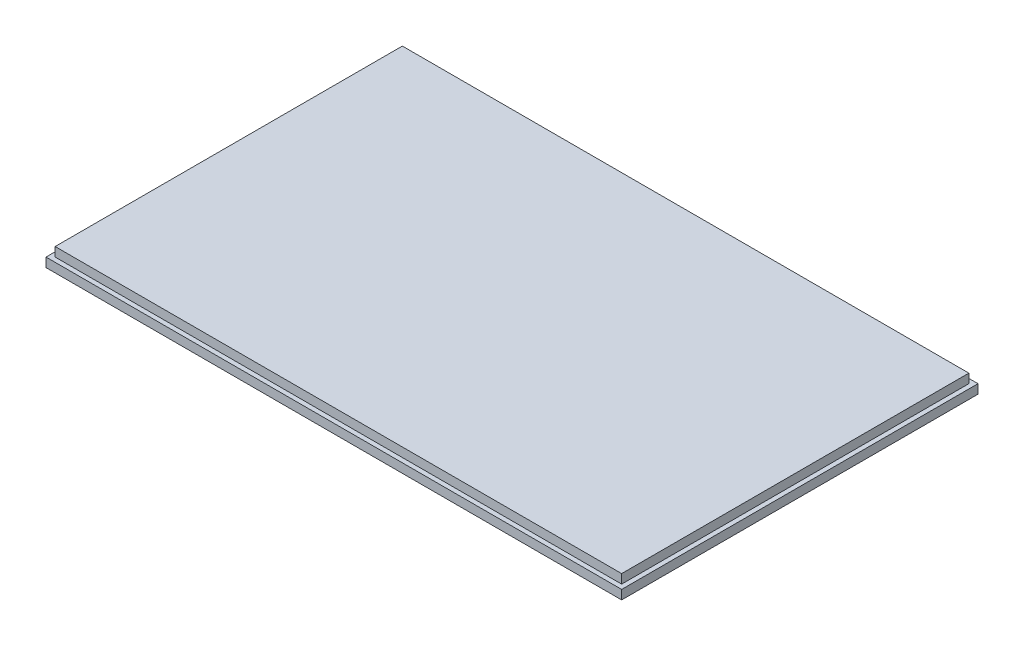
ISO-10303-21;
HEADER;
FILE_DESCRIPTION(('STEP AP214'),'2;1');
FILE_NAME('part.step','',(''),(''),'','','');
FILE_SCHEMA(('AUTOMOTIVE_DESIGN { 1 0 10303 214 1 1 1 1 }'));
ENDSEC;
DATA;
#1=APPLICATION_CONTEXT('core data for automotive mechanical design processes');
#2=APPLICATION_PROTOCOL_DEFINITION('international standard','automotive_design',2000,#1);
#3=PRODUCT_CONTEXT('',#1,'mechanical');
#4=PRODUCT('Part','Part','',(#3));
#5=PRODUCT_RELATED_PRODUCT_CATEGORY('part','',(#4));
#6=PRODUCT_DEFINITION_FORMATION('','',#4);
#7=PRODUCT_DEFINITION_CONTEXT('part definition',#1,'design');
#8=PRODUCT_DEFINITION('design','',#6,#7);
#9=PRODUCT_DEFINITION_SHAPE('','',#8);
#10=(LENGTH_UNIT() NAMED_UNIT(*) SI_UNIT(.MILLI.,.METRE.));
#11=(NAMED_UNIT(*) PLANE_ANGLE_UNIT() SI_UNIT($,.RADIAN.));
#12=(NAMED_UNIT(*) SI_UNIT($,.STERADIAN.) SOLID_ANGLE_UNIT());
#13=UNCERTAINTY_MEASURE_WITH_UNIT(LENGTH_MEASURE(1.E-05),#10,'distance_accuracy_value','');
#14=(GEOMETRIC_REPRESENTATION_CONTEXT(3) GLOBAL_UNCERTAINTY_ASSIGNED_CONTEXT((#13)) GLOBAL_UNIT_ASSIGNED_CONTEXT((#10,
#11,#12)) REPRESENTATION_CONTEXT('',''));
#15=CARTESIAN_POINT('',(0.,0.,0.));
#16=DIRECTION('',(0.,0.,1.));
#17=DIRECTION('',(1.,0.,0.));
#18=AXIS2_PLACEMENT_3D('',#15,#16,#17);
#19=CARTESIAN_POINT('',(0.,3.175,0.));
#20=DIRECTION('',(0.,-1.,0.));
#21=DIRECTION('',(0.,0.,-1.));
#22=AXIS2_PLACEMENT_3D('',#19,#20,#21);
#23=PLANE('',#22);
#24=DIRECTION('',(0.,0.,-1.));
#25=VECTOR('',#24,1.);
#26=CARTESIAN_POINT('',(100.0125,3.175,61.9125));
#27=LINE('',#26,#25);
#28=CARTESIAN_POINT('',(100.0125,3.175,61.9125));
#29=VERTEX_POINT('',#28);
#30=CARTESIAN_POINT('',(100.0125,3.175,-61.9125));
#31=VERTEX_POINT('',#30);
#32=EDGE_CURVE('E129',#29,#31,#27,.T.);
#33=ORIENTED_EDGE('',*,*,#32,.T.);
#34=DIRECTION('',(-1.,0.,0.));
#35=VECTOR('',#34,1.);
#36=CARTESIAN_POINT('',(-100.0125,3.175,-61.9125));
#37=LINE('',#36,#35);
#38=CARTESIAN_POINT('',(-100.0125,3.175,-61.9125));
#39=VERTEX_POINT('',#38);
#40=EDGE_CURVE('E132',#31,#39,#37,.T.);
#41=ORIENTED_EDGE('',*,*,#40,.T.);
#42=DIRECTION('',(0.,0.,1.));
#43=VECTOR('',#42,1.);
#44=CARTESIAN_POINT('',(-100.0125,3.175,61.9125));
#45=LINE('',#44,#43);
#46=CARTESIAN_POINT('',(-100.0125,3.175,61.9125));
#47=VERTEX_POINT('',#46);
#48=EDGE_CURVE('E135',#39,#47,#45,.T.);
#49=ORIENTED_EDGE('',*,*,#48,.T.);
#50=DIRECTION('',(1.,0.,0.));
#51=VECTOR('',#50,1.);
#52=CARTESIAN_POINT('',(-100.0125,3.175,61.9125));
#53=LINE('',#52,#51);
#54=EDGE_CURVE('E137',#47,#29,#53,.T.);
#55=ORIENTED_EDGE('',*,*,#54,.T.);
#56=EDGE_LOOP('',(#33,#41,#49,#55));
#57=FACE_BOUND('',#56,.T.);
#58=DIRECTION('',(1.,0.,0.));
#59=VECTOR('',#58,1.);
#60=CARTESIAN_POINT('',(-98.425,3.175,60.325));
#61=LINE('',#60,#59);
#62=CARTESIAN_POINT('',(-98.425,3.175,60.325));
#63=VERTEX_POINT('',#62);
#64=CARTESIAN_POINT('',(98.4249999999999,3.175,60.325));
#65=VERTEX_POINT('',#64);
#66=EDGE_CURVE('E119',#63,#65,#61,.T.);
#67=ORIENTED_EDGE('',*,*,#66,.F.);
#68=DIRECTION('',(0.,0.,1.));
#69=VECTOR('',#68,1.);
#70=CARTESIAN_POINT('',(-98.425,3.175,-60.325));
#71=LINE('',#70,#69);
#72=CARTESIAN_POINT('',(-98.425,3.175,-60.325));
#73=VERTEX_POINT('',#72);
#74=EDGE_CURVE('E116',#73,#63,#71,.T.);
#75=ORIENTED_EDGE('',*,*,#74,.F.);
#76=DIRECTION('',(-1.,0.,0.));
#77=VECTOR('',#76,1.);
#78=CARTESIAN_POINT('',(98.4249999999999,3.175,-60.325));
#79=LINE('',#78,#77);
#80=CARTESIAN_POINT('',(98.4249999999999,3.175,-60.325));
#81=VERTEX_POINT('',#80);
#82=EDGE_CURVE('E54',#81,#73,#79,.T.);
#83=ORIENTED_EDGE('',*,*,#82,.F.);
#84=DIRECTION('',(0.,0.,-1.));
#85=VECTOR('',#84,1.);
#86=CARTESIAN_POINT('',(98.4249999999999,3.175,60.325));
#87=LINE('',#86,#85);
#88=EDGE_CURVE('E49',#65,#81,#87,.T.);
#89=ORIENTED_EDGE('',*,*,#88,.F.);
#90=EDGE_LOOP('',(#67,#75,#83,#89));
#91=FACE_BOUND('',#90,.T.);
#92=ADVANCED_FACE('F34',(#57,#91),#23,.F.);
#93=CARTESIAN_POINT('',(100.0125,3.175,61.9125));
#94=DIRECTION('',(-1.,0.,0.));
#95=DIRECTION('',(0.,0.,1.));
#96=AXIS2_PLACEMENT_3D('',#93,#94,#95);
#97=PLANE('',#96);
#98=DIRECTION('',(0.,0.,-1.));
#99=VECTOR('',#98,1.);
#100=CARTESIAN_POINT('',(100.0125,0.,61.9125));
#101=LINE('',#100,#99);
#102=CARTESIAN_POINT('',(100.0125,0.,61.9125));
#103=VERTEX_POINT('',#102);
#104=CARTESIAN_POINT('',(100.0125,0.,-61.9125));
#105=VERTEX_POINT('',#104);
#106=EDGE_CURVE('E120',#103,#105,#101,.T.);
#107=ORIENTED_EDGE('',*,*,#106,.T.);
#108=DIRECTION('',(0.,-1.,0.));
#109=VECTOR('',#108,1.);
#110=CARTESIAN_POINT('',(100.0125,3.175,-61.9125));
#111=LINE('',#110,#109);
#112=EDGE_CURVE('E11',#31,#105,#111,.T.);
#113=ORIENTED_EDGE('',*,*,#112,.F.);
#114=ORIENTED_EDGE('',*,*,#32,.F.);
#115=DIRECTION('',(0.,-1.,0.));
#116=VECTOR('',#115,1.);
#117=CARTESIAN_POINT('',(100.0125,3.175,61.9125));
#118=LINE('',#117,#116);
#119=EDGE_CURVE('E138',#29,#103,#118,.T.);
#120=ORIENTED_EDGE('',*,*,#119,.T.);
#121=EDGE_LOOP('',(#107,#113,#114,#120));
#122=FACE_BOUND('',#121,.T.);
#123=ADVANCED_FACE('F36',(#122),#97,.F.);
#124=CARTESIAN_POINT('',(-100.0125,3.175,-61.9125));
#125=DIRECTION('',(0.,0.,1.));
#126=DIRECTION('',(1.,0.,0.));
#127=AXIS2_PLACEMENT_3D('',#124,#125,#126);
#128=PLANE('',#127);
#129=DIRECTION('',(-1.,0.,0.));
#130=VECTOR('',#129,1.);
#131=CARTESIAN_POINT('',(-100.0125,0.,-61.9125));
#132=LINE('',#131,#130);
#133=CARTESIAN_POINT('',(-100.0125,0.,-61.9125));
#134=VERTEX_POINT('',#133);
#135=EDGE_CURVE('E123',#105,#134,#132,.T.);
#136=ORIENTED_EDGE('',*,*,#135,.T.);
#137=DIRECTION('',(0.,-1.,0.));
#138=VECTOR('',#137,1.);
#139=CARTESIAN_POINT('',(-100.0125,3.175,-61.9125));
#140=LINE('',#139,#138);
#141=EDGE_CURVE('E42',#39,#134,#140,.T.);
#142=ORIENTED_EDGE('',*,*,#141,.F.);
#143=ORIENTED_EDGE('',*,*,#40,.F.);
#144=ORIENTED_EDGE('',*,*,#112,.T.);
#145=EDGE_LOOP('',(#136,#142,#143,#144));
#146=FACE_BOUND('',#145,.T.);
#147=ADVANCED_FACE('F168',(#146),#128,.F.);
#148=CARTESIAN_POINT('',(-100.0125,3.175,61.9125));
#149=DIRECTION('',(1.,0.,0.));
#150=DIRECTION('',(0.,0.,-1.));
#151=AXIS2_PLACEMENT_3D('',#148,#149,#150);
#152=PLANE('',#151);
#153=DIRECTION('',(0.,0.,1.));
#154=VECTOR('',#153,1.);
#155=CARTESIAN_POINT('',(-100.0125,0.,61.9125));
#156=LINE('',#155,#154);
#157=CARTESIAN_POINT('',(-100.0125,0.,61.9125));
#158=VERTEX_POINT('',#157);
#159=EDGE_CURVE('E141',#134,#158,#156,.T.);
#160=ORIENTED_EDGE('',*,*,#159,.T.);
#161=DIRECTION('',(0.,-1.,0.));
#162=VECTOR('',#161,1.);
#163=CARTESIAN_POINT('',(-100.0125,3.175,61.9125));
#164=LINE('',#163,#162);
#165=EDGE_CURVE('E146',#47,#158,#164,.T.);
#166=ORIENTED_EDGE('',*,*,#165,.F.);
#167=ORIENTED_EDGE('',*,*,#48,.F.);
#168=ORIENTED_EDGE('',*,*,#141,.T.);
#169=EDGE_LOOP('',(#160,#166,#167,#168));
#170=FACE_BOUND('',#169,.T.);
#171=ADVANCED_FACE('F153',(#170),#152,.F.);
#172=CARTESIAN_POINT('',(-100.0125,3.175,61.9125));
#173=DIRECTION('',(0.,0.,-1.));
#174=DIRECTION('',(-1.,0.,0.));
#175=AXIS2_PLACEMENT_3D('',#172,#173,#174);
#176=PLANE('',#175);
#177=DIRECTION('',(1.,0.,0.));
#178=VECTOR('',#177,1.);
#179=CARTESIAN_POINT('',(-100.0125,0.,61.9125));
#180=LINE('',#179,#178);
#181=EDGE_CURVE('E133',#158,#103,#180,.T.);
#182=ORIENTED_EDGE('',*,*,#181,.T.);
#183=ORIENTED_EDGE('',*,*,#119,.F.);
#184=ORIENTED_EDGE('',*,*,#54,.F.);
#185=ORIENTED_EDGE('',*,*,#165,.T.);
#186=EDGE_LOOP('',(#182,#183,#184,#185));
#187=FACE_BOUND('',#186,.T.);
#188=ADVANCED_FACE('F162',(#187),#176,.F.);
#189=CARTESIAN_POINT('',(0.,0.,0.));
#190=DIRECTION('',(0.,-1.,0.));
#191=DIRECTION('',(0.,0.,-1.));
#192=AXIS2_PLACEMENT_3D('',#189,#190,#191);
#193=PLANE('',#192);
#194=ORIENTED_EDGE('',*,*,#106,.F.);
#195=ORIENTED_EDGE('',*,*,#181,.F.);
#196=ORIENTED_EDGE('',*,*,#159,.F.);
#197=ORIENTED_EDGE('',*,*,#135,.F.);
#198=EDGE_LOOP('',(#194,#195,#196,#197));
#199=FACE_BOUND('',#198,.T.);
#200=ADVANCED_FACE('F159',(#199),#193,.T.);
#201=CARTESIAN_POINT('',(-98.425,6.35,60.325));
#202=DIRECTION('',(0.,0.,-1.));
#203=DIRECTION('',(-1.,0.,0.));
#204=AXIS2_PLACEMENT_3D('',#201,#202,#203);
#205=PLANE('',#204);
#206=ORIENTED_EDGE('',*,*,#66,.T.);
#207=DIRECTION('',(0.,-1.,0.));
#208=VECTOR('',#207,1.);
#209=CARTESIAN_POINT('',(98.4249999999999,6.35,60.325));
#210=LINE('',#209,#208);
#211=CARTESIAN_POINT('',(98.4249999999999,6.35,60.325));
#212=VERTEX_POINT('',#211);
#213=EDGE_CURVE('E100',#212,#65,#210,.T.);
#214=ORIENTED_EDGE('',*,*,#213,.F.);
#215=DIRECTION('',(1.,0.,0.));
#216=VECTOR('',#215,1.);
#217=CARTESIAN_POINT('',(-98.425,6.35,60.325));
#218=LINE('',#217,#216);
#219=CARTESIAN_POINT('',(-98.425,6.35,60.325));
#220=VERTEX_POINT('',#219);
#221=EDGE_CURVE('E107',#220,#212,#218,.T.);
#222=ORIENTED_EDGE('',*,*,#221,.F.);
#223=DIRECTION('',(0.,-1.,0.));
#224=VECTOR('',#223,1.);
#225=CARTESIAN_POINT('',(-98.425,6.35,60.325));
#226=LINE('',#225,#224);
#227=EDGE_CURVE('E261',#220,#63,#226,.T.);
#228=ORIENTED_EDGE('',*,*,#227,.T.);
#229=EDGE_LOOP('',(#206,#214,#222,#228));
#230=FACE_BOUND('',#229,.T.);
#231=ADVANCED_FACE('F118',(#230),#205,.F.);
#232=CARTESIAN_POINT('',(98.4249999999999,6.35,60.325));
#233=DIRECTION('',(-1.,0.,0.));
#234=DIRECTION('',(0.,0.,1.));
#235=AXIS2_PLACEMENT_3D('',#232,#233,#234);
#236=PLANE('',#235);
#237=ORIENTED_EDGE('',*,*,#88,.T.);
#238=DIRECTION('',(0.,-1.,0.));
#239=VECTOR('',#238,1.);
#240=CARTESIAN_POINT('',(98.4249999999999,6.35,-60.325));
#241=LINE('',#240,#239);
#242=CARTESIAN_POINT('',(98.4249999999999,6.35,-60.325));
#243=VERTEX_POINT('',#242);
#244=EDGE_CURVE('E103',#243,#81,#241,.T.);
#245=ORIENTED_EDGE('',*,*,#244,.F.);
#246=DIRECTION('',(0.,0.,-1.));
#247=VECTOR('',#246,1.);
#248=CARTESIAN_POINT('',(98.4249999999999,6.35,60.325));
#249=LINE('',#248,#247);
#250=EDGE_CURVE('E96',#212,#243,#249,.T.);
#251=ORIENTED_EDGE('',*,*,#250,.F.);
#252=ORIENTED_EDGE('',*,*,#213,.T.);
#253=EDGE_LOOP('',(#237,#245,#251,#252));
#254=FACE_BOUND('',#253,.T.);
#255=ADVANCED_FACE('F98',(#254),#236,.F.);
#256=CARTESIAN_POINT('',(98.4249999999999,6.35,-60.325));
#257=DIRECTION('',(0.,0.,1.));
#258=DIRECTION('',(1.,0.,0.));
#259=AXIS2_PLACEMENT_3D('',#256,#257,#258);
#260=PLANE('',#259);
#261=ORIENTED_EDGE('',*,*,#82,.T.);
#262=DIRECTION('',(0.,-1.,0.));
#263=VECTOR('',#262,1.);
#264=CARTESIAN_POINT('',(-98.425,6.35,-60.325));
#265=LINE('',#264,#263);
#266=CARTESIAN_POINT('',(-98.425,6.35,-60.325));
#267=VERTEX_POINT('',#266);
#268=EDGE_CURVE('E125',#267,#73,#265,.T.);
#269=ORIENTED_EDGE('',*,*,#268,.F.);
#270=DIRECTION('',(-1.,0.,0.));
#271=VECTOR('',#270,1.);
#272=CARTESIAN_POINT('',(98.4249999999999,6.35,-60.325));
#273=LINE('',#272,#271);
#274=EDGE_CURVE('E106',#243,#267,#273,.T.);
#275=ORIENTED_EDGE('',*,*,#274,.F.);
#276=ORIENTED_EDGE('',*,*,#244,.T.);
#277=EDGE_LOOP('',(#261,#269,#275,#276));
#278=FACE_BOUND('',#277,.T.);
#279=ADVANCED_FACE('F204',(#278),#260,.F.);
#280=CARTESIAN_POINT('',(-98.425,6.35,-60.325));
#281=DIRECTION('',(1.,0.,0.));
#282=DIRECTION('',(0.,0.,-1.));
#283=AXIS2_PLACEMENT_3D('',#280,#281,#282);
#284=PLANE('',#283);
#285=ORIENTED_EDGE('',*,*,#74,.T.);
#286=ORIENTED_EDGE('',*,*,#227,.F.);
#287=DIRECTION('',(0.,0.,1.));
#288=VECTOR('',#287,1.);
#289=CARTESIAN_POINT('',(-98.425,6.35,-60.325));
#290=LINE('',#289,#288);
#291=EDGE_CURVE('E112',#267,#220,#290,.T.);
#292=ORIENTED_EDGE('',*,*,#291,.F.);
#293=ORIENTED_EDGE('',*,*,#268,.T.);
#294=EDGE_LOOP('',(#285,#286,#292,#293));
#295=FACE_BOUND('',#294,.T.);
#296=ADVANCED_FACE('F210',(#295),#284,.F.);
#297=CARTESIAN_POINT('',(0.,6.35,0.));
#298=DIRECTION('',(0.,1.,0.));
#299=DIRECTION('',(0.,0.,1.));
#300=AXIS2_PLACEMENT_3D('',#297,#298,#299);
#301=PLANE('',#300);
#302=ORIENTED_EDGE('',*,*,#221,.T.);
#303=ORIENTED_EDGE('',*,*,#250,.T.);
#304=ORIENTED_EDGE('',*,*,#274,.T.);
#305=ORIENTED_EDGE('',*,*,#291,.T.);
#306=EDGE_LOOP('',(#302,#303,#304,#305));
#307=FACE_BOUND('',#306,.T.);
#308=ADVANCED_FACE('F110',(#307),#301,.T.);
#309=CLOSED_SHELL('',(#92,#123,#147,#171,#188,#200,#231,#255,#279,#296,#308));
#310=MANIFOLD_SOLID_BREP('B2',#309);
#311=ADVANCED_BREP_SHAPE_REPRESENTATION('',(#18,#310),#14);
#312=SHAPE_DEFINITION_REPRESENTATION(#9,#311);
ENDSEC;
END-ISO-10303-21;
